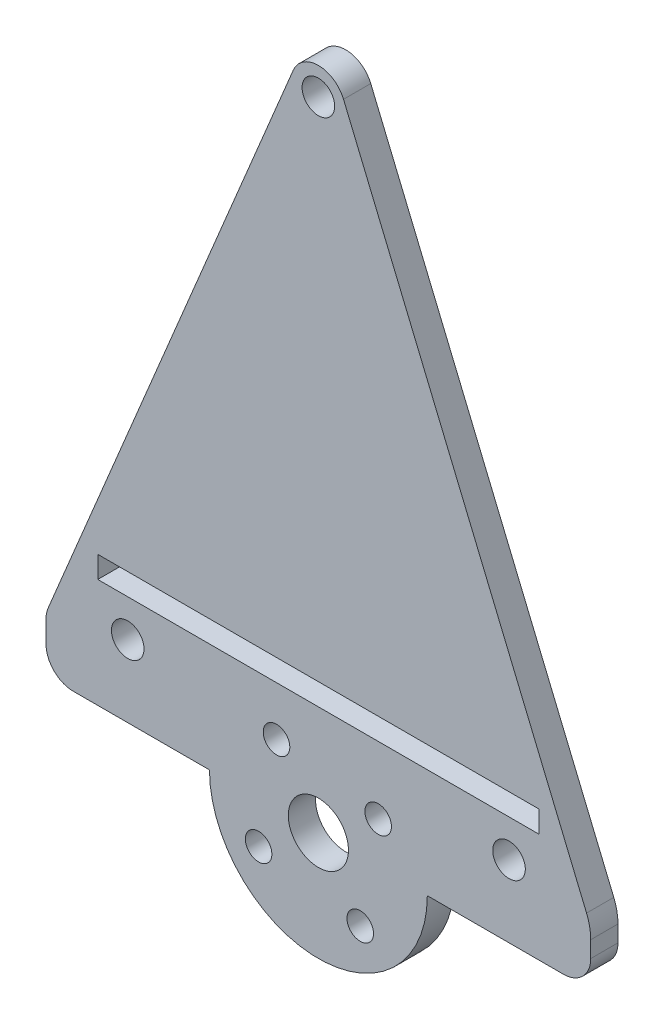
ISO-10303-21;
HEADER;
FILE_DESCRIPTION(('STEP AP214'),'2;1');
FILE_NAME('part.step','',(''),(''),'','','');
FILE_SCHEMA(('AUTOMOTIVE_DESIGN { 1 0 10303 214 1 1 1 1 }'));
ENDSEC;
DATA;
#1=APPLICATION_CONTEXT('core data for automotive mechanical design processes');
#2=APPLICATION_PROTOCOL_DEFINITION('international standard','automotive_design',2000,#1);
#3=PRODUCT_CONTEXT('',#1,'mechanical');
#4=PRODUCT('Part','Part','',(#3));
#5=PRODUCT_RELATED_PRODUCT_CATEGORY('part','',(#4));
#6=PRODUCT_DEFINITION_FORMATION('','',#4);
#7=PRODUCT_DEFINITION_CONTEXT('part definition',#1,'design');
#8=PRODUCT_DEFINITION('design','',#6,#7);
#9=PRODUCT_DEFINITION_SHAPE('','',#8);
#10=(LENGTH_UNIT() NAMED_UNIT(*) SI_UNIT(.MILLI.,.METRE.));
#11=(NAMED_UNIT(*) PLANE_ANGLE_UNIT() SI_UNIT($,.RADIAN.));
#12=(NAMED_UNIT(*) SI_UNIT($,.STERADIAN.) SOLID_ANGLE_UNIT());
#13=UNCERTAINTY_MEASURE_WITH_UNIT(LENGTH_MEASURE(1.E-05),#10,'distance_accuracy_value','');
#14=(GEOMETRIC_REPRESENTATION_CONTEXT(3) GLOBAL_UNCERTAINTY_ASSIGNED_CONTEXT((#13)) GLOBAL_UNIT_ASSIGNED_CONTEXT((#10,
#11,#12)) REPRESENTATION_CONTEXT('',''));
#15=CARTESIAN_POINT('',(0.,0.,0.));
#16=DIRECTION('',(0.,0.,1.));
#17=DIRECTION('',(1.,0.,0.));
#18=AXIS2_PLACEMENT_3D('',#15,#16,#17);
#19=CARTESIAN_POINT('',(28.575,-3.175,3.175));
#20=DIRECTION('',(0.,0.,-1.));
#21=DIRECTION('',(-1.,0.,0.));
#22=AXIS2_PLACEMENT_3D('',#19,#20,#21);
#23=CYLINDRICAL_SURFACE('',#22,3.175);
#24=DIRECTION('',(0.,0.,-1.));
#25=VECTOR('',#24,1.);
#26=CARTESIAN_POINT('',(31.75,-3.175,3.175));
#27=LINE('',#26,#25);
#28=CARTESIAN_POINT('',(31.75,-3.175,3.175));
#29=VERTEX_POINT('',#28);
#30=CARTESIAN_POINT('',(31.75,-3.175,0.));
#31=VERTEX_POINT('',#30);
#32=EDGE_CURVE('E294',#29,#31,#27,.T.);
#33=ORIENTED_EDGE('',*,*,#32,.F.);
#34=CARTESIAN_POINT('',(28.575,-3.175,3.175));
#35=DIRECTION('',(0.,0.,1.));
#36=DIRECTION('',(1.,0.,0.));
#37=AXIS2_PLACEMENT_3D('',#34,#35,#36);
#38=CIRCLE('',#37,3.175);
#39=CARTESIAN_POINT('',(28.575,-6.35,3.175));
#40=VERTEX_POINT('',#39);
#41=EDGE_CURVE('E40',#40,#29,#38,.T.);
#42=ORIENTED_EDGE('',*,*,#41,.F.);
#43=DIRECTION('',(0.,0.,-1.));
#44=VECTOR('',#43,1.);
#45=CARTESIAN_POINT('',(28.575,-6.35,3.175));
#46=LINE('',#45,#44);
#47=CARTESIAN_POINT('',(28.575,-6.35,0.));
#48=VERTEX_POINT('',#47);
#49=EDGE_CURVE('E297',#48,#40,#46,.F.);
#50=ORIENTED_EDGE('',*,*,#49,.F.);
#51=CARTESIAN_POINT('',(28.575,-3.175,0.));
#52=DIRECTION('',(0.,0.,1.));
#53=DIRECTION('',(1.,0.,0.));
#54=AXIS2_PLACEMENT_3D('',#51,#52,#53);
#55=CIRCLE('',#54,3.175);
#56=EDGE_CURVE('E11',#31,#48,#55,.F.);
#57=ORIENTED_EDGE('',*,*,#56,.F.);
#58=EDGE_LOOP('',(#33,#42,#50,#57));
#59=FACE_BOUND('',#58,.T.);
#60=ADVANCED_FACE('F33',(#59),#23,.T.);
#61=CARTESIAN_POINT('',(25.4,-1.26999999999999,3.175));
#62=DIRECTION('',(0.,0.,-1.));
#63=DIRECTION('',(-1.,0.,0.));
#64=AXIS2_PLACEMENT_3D('',#61,#62,#63);
#65=CYLINDRICAL_SURFACE('',#64,6.35);
#66=DIRECTION('',(0.,0.,-1.));
#67=VECTOR('',#66,1.);
#68=CARTESIAN_POINT('',(31.2615384615385,1.17230769230768,3.175));
#69=LINE('',#68,#67);
#70=CARTESIAN_POINT('',(31.2615384615385,1.17230769230768,3.175));
#71=VERTEX_POINT('',#70);
#72=CARTESIAN_POINT('',(31.2615384615385,1.17230769230768,0.));
#73=VERTEX_POINT('',#72);
#74=EDGE_CURVE('E283',#71,#73,#69,.T.);
#75=ORIENTED_EDGE('',*,*,#74,.F.);
#76=CARTESIAN_POINT('',(25.4,-1.26999999999999,3.175));
#77=DIRECTION('',(0.,0.,1.));
#78=DIRECTION('',(1.,0.,0.));
#79=AXIS2_PLACEMENT_3D('',#76,#77,#78);
#80=CIRCLE('',#79,6.35);
#81=CARTESIAN_POINT('',(31.75,-1.26999999999999,3.175));
#82=VERTEX_POINT('',#81);
#83=EDGE_CURVE('E289',#82,#71,#80,.T.);
#84=ORIENTED_EDGE('',*,*,#83,.F.);
#85=DIRECTION('',(0.,0.,-1.));
#86=VECTOR('',#85,1.);
#87=CARTESIAN_POINT('',(31.75,-1.26999999999999,3.175));
#88=LINE('',#87,#86);
#89=CARTESIAN_POINT('',(31.75,-1.26999999999999,0.));
#90=VERTEX_POINT('',#89);
#91=EDGE_CURVE('E286',#90,#82,#88,.F.);
#92=ORIENTED_EDGE('',*,*,#91,.F.);
#93=CARTESIAN_POINT('',(25.4,-1.26999999999999,0.));
#94=DIRECTION('',(0.,0.,1.));
#95=DIRECTION('',(1.,0.,0.));
#96=AXIS2_PLACEMENT_3D('',#93,#94,#95);
#97=CIRCLE('',#96,6.35);
#98=EDGE_CURVE('E291',#73,#90,#97,.F.);
#99=ORIENTED_EDGE('',*,*,#98,.F.);
#100=EDGE_LOOP('',(#75,#84,#92,#99));
#101=FACE_BOUND('',#100,.T.);
#102=ADVANCED_FACE('F313',(#101),#65,.T.);
#103=CARTESIAN_POINT('',(0.,67.945,3.175));
#104=DIRECTION('',(0.,0.,-1.));
#105=DIRECTION('',(-1.,0.,0.));
#106=AXIS2_PLACEMENT_3D('',#103,#104,#105);
#107=CYLINDRICAL_SURFACE('',#106,3.175);
#108=DIRECTION('',(0.,0.,-1.));
#109=VECTOR('',#108,1.);
#110=CARTESIAN_POINT('',(-2.93076923076923,69.1661538461538,3.175));
#111=LINE('',#110,#109);
#112=CARTESIAN_POINT('',(-2.93076923076923,69.1661538461538,3.175));
#113=VERTEX_POINT('',#112);
#114=CARTESIAN_POINT('',(-2.93076923076923,69.1661538461538,0.));
#115=VERTEX_POINT('',#114);
#116=EDGE_CURVE('E272',#113,#115,#111,.T.);
#117=ORIENTED_EDGE('',*,*,#116,.F.);
#118=CARTESIAN_POINT('',(0.,67.945,3.175));
#119=DIRECTION('',(0.,0.,1.));
#120=DIRECTION('',(1.,0.,0.));
#121=AXIS2_PLACEMENT_3D('',#118,#119,#120);
#122=CIRCLE('',#121,3.175);
#123=CARTESIAN_POINT('',(2.93076923076923,69.1661538461538,3.175));
#124=VERTEX_POINT('',#123);
#125=EDGE_CURVE('E278',#124,#113,#122,.T.);
#126=ORIENTED_EDGE('',*,*,#125,.F.);
#127=DIRECTION('',(0.,0.,-1.));
#128=VECTOR('',#127,1.);
#129=CARTESIAN_POINT('',(2.93076923076923,69.1661538461538,3.175));
#130=LINE('',#129,#128);
#131=CARTESIAN_POINT('',(2.93076923076923,69.1661538461538,0.));
#132=VERTEX_POINT('',#131);
#133=EDGE_CURVE('E275',#132,#124,#130,.F.);
#134=ORIENTED_EDGE('',*,*,#133,.F.);
#135=CARTESIAN_POINT('',(0.,67.945,0.));
#136=DIRECTION('',(0.,0.,1.));
#137=DIRECTION('',(1.,0.,0.));
#138=AXIS2_PLACEMENT_3D('',#135,#136,#137);
#139=CIRCLE('',#138,3.175);
#140=EDGE_CURVE('E280',#115,#132,#139,.F.);
#141=ORIENTED_EDGE('',*,*,#140,.F.);
#142=EDGE_LOOP('',(#117,#126,#134,#141));
#143=FACE_BOUND('',#142,.T.);
#144=ADVANCED_FACE('F320',(#143),#107,.T.);
#145=CARTESIAN_POINT('',(-28.575,-0.634999999999997,3.175));
#146=DIRECTION('',(0.,0.,1.));
#147=DIRECTION('',(1.,0.,0.));
#148=AXIS2_PLACEMENT_3D('',#145,#146,#147);
#149=CYLINDRICAL_SURFACE('',#148,3.175);
#150=DIRECTION('',(0.,0.,1.));
#151=VECTOR('',#150,1.);
#152=CARTESIAN_POINT('',(-31.5057692307692,0.586153846153847,3.175));
#153=LINE('',#152,#151);
#154=CARTESIAN_POINT('',(-31.5057692307692,0.586153846153861,0.));
#155=VERTEX_POINT('',#154);
#156=CARTESIAN_POINT('',(-31.5057692307692,0.586153846153861,3.175));
#157=VERTEX_POINT('',#156);
#158=EDGE_CURVE('E261',#155,#157,#153,.T.);
#159=ORIENTED_EDGE('',*,*,#158,.F.);
#160=CARTESIAN_POINT('',(-28.575,-0.634999999999997,0.));
#161=DIRECTION('',(0.,0.,1.));
#162=DIRECTION('',(1.,0.,0.));
#163=AXIS2_PLACEMENT_3D('',#160,#161,#162);
#164=CIRCLE('',#163,3.175);
#165=CARTESIAN_POINT('',(-31.75,-0.634999999999987,0.));
#166=VERTEX_POINT('',#165);
#167=EDGE_CURVE('E267',#166,#155,#164,.F.);
#168=ORIENTED_EDGE('',*,*,#167,.F.);
#169=DIRECTION('',(0.,0.,1.));
#170=VECTOR('',#169,1.);
#171=CARTESIAN_POINT('',(-31.75,-0.634999999999997,3.175));
#172=LINE('',#171,#170);
#173=CARTESIAN_POINT('',(-31.75,-0.634999999999987,3.175));
#174=VERTEX_POINT('',#173);
#175=EDGE_CURVE('E264',#174,#166,#172,.F.);
#176=ORIENTED_EDGE('',*,*,#175,.F.);
#177=CARTESIAN_POINT('',(-28.575,-0.634999999999997,3.175));
#178=DIRECTION('',(0.,0.,1.));
#179=DIRECTION('',(1.,0.,0.));
#180=AXIS2_PLACEMENT_3D('',#177,#178,#179);
#181=CIRCLE('',#180,3.175);
#182=EDGE_CURVE('E270',#157,#174,#181,.T.);
#183=ORIENTED_EDGE('',*,*,#182,.F.);
#184=EDGE_LOOP('',(#159,#168,#176,#183));
#185=FACE_BOUND('',#184,.T.);
#186=ADVANCED_FACE('F332',(#185),#149,.T.);
#187=CARTESIAN_POINT('',(-28.575,-3.175,3.175));
#188=DIRECTION('',(0.,0.,-1.));
#189=DIRECTION('',(-1.,0.,0.));
#190=AXIS2_PLACEMENT_3D('',#187,#188,#189);
#191=CYLINDRICAL_SURFACE('',#190,3.175);
#192=DIRECTION('',(0.,0.,-1.));
#193=VECTOR('',#192,1.);
#194=CARTESIAN_POINT('',(-28.575,-6.35,3.175));
#195=LINE('',#194,#193);
#196=CARTESIAN_POINT('',(-28.575,-6.35,3.175));
#197=VERTEX_POINT('',#196);
#198=CARTESIAN_POINT('',(-28.575,-6.35,0.));
#199=VERTEX_POINT('',#198);
#200=EDGE_CURVE('E250',#197,#199,#195,.T.);
#201=ORIENTED_EDGE('',*,*,#200,.F.);
#202=CARTESIAN_POINT('',(-28.575,-3.175,3.175));
#203=DIRECTION('',(0.,0.,1.));
#204=DIRECTION('',(1.,0.,0.));
#205=AXIS2_PLACEMENT_3D('',#202,#203,#204);
#206=CIRCLE('',#205,3.175);
#207=CARTESIAN_POINT('',(-31.75,-3.175,3.175));
#208=VERTEX_POINT('',#207);
#209=EDGE_CURVE('E256',#208,#197,#206,.T.);
#210=ORIENTED_EDGE('',*,*,#209,.F.);
#211=DIRECTION('',(0.,0.,-1.));
#212=VECTOR('',#211,1.);
#213=CARTESIAN_POINT('',(-31.75,-3.175,3.175));
#214=LINE('',#213,#212);
#215=CARTESIAN_POINT('',(-31.75,-3.175,0.));
#216=VERTEX_POINT('',#215);
#217=EDGE_CURVE('E253',#216,#208,#214,.F.);
#218=ORIENTED_EDGE('',*,*,#217,.F.);
#219=CARTESIAN_POINT('',(-28.575,-3.175,0.));
#220=DIRECTION('',(0.,0.,1.));
#221=DIRECTION('',(1.,0.,0.));
#222=AXIS2_PLACEMENT_3D('',#219,#220,#221);
#223=CIRCLE('',#222,3.175);
#224=EDGE_CURVE('E258',#199,#216,#223,.F.);
#225=ORIENTED_EDGE('',*,*,#224,.F.);
#226=EDGE_LOOP('',(#201,#210,#218,#225));
#227=FACE_BOUND('',#226,.T.);
#228=ADVANCED_FACE('F341',(#227),#191,.T.);
#229=CARTESIAN_POINT('',(0.,76.2,3.175));
#230=DIRECTION('',(-0.923076923076923,-0.384615384615385,0.));
#231=DIRECTION('',(0.384615384615385,-0.923076923076923,0.));
#232=AXIS2_PLACEMENT_3D('',#229,#230,#231);
#233=PLANE('',#232);
#234=DIRECTION('',(-0.384615384615385,0.923076923076923,0.));
#235=VECTOR('',#234,1.);
#236=CARTESIAN_POINT('',(0.,76.2,3.175));
#237=LINE('',#236,#235);
#238=EDGE_CURVE('E215',#71,#124,#237,.T.);
#239=ORIENTED_EDGE('',*,*,#238,.F.);
#240=ORIENTED_EDGE('',*,*,#74,.T.);
#241=DIRECTION('',(-0.384615384615385,0.923076923076923,0.));
#242=VECTOR('',#241,1.);
#243=CARTESIAN_POINT('',(0.,76.2,0.));
#244=LINE('',#243,#242);
#245=EDGE_CURVE('E212',#73,#132,#244,.T.);
#246=ORIENTED_EDGE('',*,*,#245,.T.);
#247=ORIENTED_EDGE('',*,*,#133,.T.);
#248=EDGE_LOOP('',(#239,#240,#246,#247));
#249=FACE_BOUND('',#248,.T.);
#250=ADVANCED_FACE('F322',(#249),#233,.F.);
#251=CARTESIAN_POINT('',(0.,76.2,3.175));
#252=DIRECTION('',(0.923076923076923,-0.384615384615385,0.));
#253=DIRECTION('',(0.384615384615385,0.923076923076923,0.));
#254=AXIS2_PLACEMENT_3D('',#251,#252,#253);
#255=PLANE('',#254);
#256=DIRECTION('',(-0.384615384615385,-0.923076923076923,0.));
#257=VECTOR('',#256,1.);
#258=CARTESIAN_POINT('',(0.,76.2,3.175));
#259=LINE('',#258,#257);
#260=EDGE_CURVE('E217',#113,#157,#259,.T.);
#261=ORIENTED_EDGE('',*,*,#260,.F.);
#262=ORIENTED_EDGE('',*,*,#116,.T.);
#263=DIRECTION('',(-0.384615384615385,-0.923076923076923,0.));
#264=VECTOR('',#263,1.);
#265=CARTESIAN_POINT('',(0.,76.2,0.));
#266=LINE('',#265,#264);
#267=EDGE_CURVE('E233',#115,#155,#266,.T.);
#268=ORIENTED_EDGE('',*,*,#267,.T.);
#269=ORIENTED_EDGE('',*,*,#158,.T.);
#270=EDGE_LOOP('',(#261,#262,#268,#269));
#271=FACE_BOUND('',#270,.T.);
#272=ADVANCED_FACE('F327',(#271),#255,.F.);
#273=CARTESIAN_POINT('',(-31.75,0.,3.175));
#274=DIRECTION('',(1.,0.,0.));
#275=DIRECTION('',(0.,0.,-1.));
#276=AXIS2_PLACEMENT_3D('',#273,#274,#275);
#277=PLANE('',#276);
#278=DIRECTION('',(0.,-1.,0.));
#279=VECTOR('',#278,1.);
#280=CARTESIAN_POINT('',(-31.75,0.,3.175));
#281=LINE('',#280,#279);
#282=EDGE_CURVE('E220',#174,#208,#281,.T.);
#283=ORIENTED_EDGE('',*,*,#282,.F.);
#284=ORIENTED_EDGE('',*,*,#175,.T.);
#285=DIRECTION('',(0.,-1.,0.));
#286=VECTOR('',#285,1.);
#287=CARTESIAN_POINT('',(-31.75,0.,0.));
#288=LINE('',#287,#286);
#289=EDGE_CURVE('E235',#166,#216,#288,.T.);
#290=ORIENTED_EDGE('',*,*,#289,.T.);
#291=ORIENTED_EDGE('',*,*,#217,.T.);
#292=EDGE_LOOP('',(#283,#284,#290,#291));
#293=FACE_BOUND('',#292,.T.);
#294=ADVANCED_FACE('F336',(#293),#277,.F.);
#295=CARTESIAN_POINT('',(-31.75,-6.35,3.175));
#296=DIRECTION('',(0.,1.,0.));
#297=DIRECTION('',(0.,0.,1.));
#298=AXIS2_PLACEMENT_3D('',#295,#296,#297);
#299=PLANE('',#298);
#300=DIRECTION('',(1.,0.,0.));
#301=VECTOR('',#300,1.);
#302=CARTESIAN_POINT('',(-31.75,-6.35,3.175));
#303=LINE('',#302,#301);
#304=CARTESIAN_POINT('',(-12.7,-6.35,3.175));
#305=VERTEX_POINT('',#304);
#306=EDGE_CURVE('E222',#197,#305,#303,.T.);
#307=ORIENTED_EDGE('',*,*,#306,.F.);
#308=ORIENTED_EDGE('',*,*,#200,.T.);
#309=DIRECTION('',(1.,0.,0.));
#310=VECTOR('',#309,1.);
#311=CARTESIAN_POINT('',(-31.75,-6.35,0.));
#312=LINE('',#311,#310);
#313=CARTESIAN_POINT('',(-12.7,-6.35,0.));
#314=VERTEX_POINT('',#313);
#315=EDGE_CURVE('E237',#199,#314,#312,.T.);
#316=ORIENTED_EDGE('',*,*,#315,.T.);
#317=DIRECTION('',(0.,0.,-1.));
#318=VECTOR('',#317,1.);
#319=CARTESIAN_POINT('',(-12.7,-6.35,3.175));
#320=LINE('',#319,#318);
#321=EDGE_CURVE('E247',#305,#314,#320,.T.);
#322=ORIENTED_EDGE('',*,*,#321,.F.);
#323=EDGE_LOOP('',(#307,#308,#316,#322));
#324=FACE_BOUND('',#323,.T.);
#325=ADVANCED_FACE('F346',(#324),#299,.F.);
#326=CARTESIAN_POINT('',(0.,-6.35,3.175));
#327=DIRECTION('',(0.,0.,-1.));
#328=DIRECTION('',(-1.,0.,0.));
#329=AXIS2_PLACEMENT_3D('',#326,#327,#328);
#330=CYLINDRICAL_SURFACE('',#329,12.7);
#331=CARTESIAN_POINT('',(0.,-6.35,0.));
#332=DIRECTION('',(0.,0.,1.));
#333=DIRECTION('',(1.,0.,0.));
#334=AXIS2_PLACEMENT_3D('',#331,#332,#333);
#335=CIRCLE('',#334,12.7);
#336=CARTESIAN_POINT('',(12.7,-6.35,0.));
#337=VERTEX_POINT('',#336);
#338=EDGE_CURVE('E239',#314,#337,#335,.T.);
#339=ORIENTED_EDGE('',*,*,#338,.T.);
#340=DIRECTION('',(0.,0.,-1.));
#341=VECTOR('',#340,1.);
#342=CARTESIAN_POINT('',(12.7,-6.35,3.175));
#343=LINE('',#342,#341);
#344=CARTESIAN_POINT('',(12.7,-6.35,3.175));
#345=VERTEX_POINT('',#344);
#346=EDGE_CURVE('E231',#345,#337,#343,.T.);
#347=ORIENTED_EDGE('',*,*,#346,.F.);
#348=CARTESIAN_POINT('',(0.,-6.35,3.175));
#349=DIRECTION('',(0.,0.,1.));
#350=DIRECTION('',(1.,0.,0.));
#351=AXIS2_PLACEMENT_3D('',#348,#349,#350);
#352=CIRCLE('',#351,12.7);
#353=EDGE_CURVE('E224',#305,#345,#352,.T.);
#354=ORIENTED_EDGE('',*,*,#353,.F.);
#355=ORIENTED_EDGE('',*,*,#321,.T.);
#356=EDGE_LOOP('',(#339,#347,#354,#355));
#357=FACE_BOUND('',#356,.T.);
#358=ADVANCED_FACE('F350',(#357),#330,.T.);
#359=CARTESIAN_POINT('',(31.75,-6.35,3.175));
#360=DIRECTION('',(0.,1.,0.));
#361=DIRECTION('',(-1.,0.,0.));
#362=AXIS2_PLACEMENT_3D('',#359,#360,#361);
#363=PLANE('',#362);
#364=DIRECTION('',(1.,0.,0.));
#365=VECTOR('',#364,1.);
#366=CARTESIAN_POINT('',(31.75,-6.35,0.));
#367=LINE('',#366,#365);
#368=EDGE_CURVE('E241',#337,#48,#367,.T.);
#369=ORIENTED_EDGE('',*,*,#368,.T.);
#370=ORIENTED_EDGE('',*,*,#49,.T.);
#371=DIRECTION('',(1.,0.,0.));
#372=VECTOR('',#371,1.);
#373=CARTESIAN_POINT('',(31.75,-6.35,3.175));
#374=LINE('',#373,#372);
#375=EDGE_CURVE('E226',#345,#40,#374,.T.);
#376=ORIENTED_EDGE('',*,*,#375,.F.);
#377=ORIENTED_EDGE('',*,*,#346,.T.);
#378=EDGE_LOOP('',(#369,#370,#376,#377));
#379=FACE_BOUND('',#378,.T.);
#380=ADVANCED_FACE('F354',(#379),#363,.F.);
#381=CARTESIAN_POINT('',(31.75,0.,3.175));
#382=DIRECTION('',(-1.,0.,0.));
#383=DIRECTION('',(0.,0.,1.));
#384=AXIS2_PLACEMENT_3D('',#381,#382,#383);
#385=PLANE('',#384);
#386=DIRECTION('',(0.,1.,0.));
#387=VECTOR('',#386,1.);
#388=CARTESIAN_POINT('',(31.75,0.,3.175));
#389=LINE('',#388,#387);
#390=EDGE_CURVE('E229',#29,#82,#389,.T.);
#391=ORIENTED_EDGE('',*,*,#390,.F.);
#392=ORIENTED_EDGE('',*,*,#32,.T.);
#393=DIRECTION('',(0.,1.,0.));
#394=VECTOR('',#393,1.);
#395=CARTESIAN_POINT('',(31.75,0.,0.));
#396=LINE('',#395,#394);
#397=EDGE_CURVE('E218',#31,#90,#396,.T.);
#398=ORIENTED_EDGE('',*,*,#397,.T.);
#399=ORIENTED_EDGE('',*,*,#91,.T.);
#400=EDGE_LOOP('',(#391,#392,#398,#399));
#401=FACE_BOUND('',#400,.T.);
#402=ADVANCED_FACE('F309',(#401),#385,.F.);
#403=CARTESIAN_POINT('',(0.,-6.35,3.175));
#404=DIRECTION('',(0.,0.,1.));
#405=DIRECTION('',(1.,0.,0.));
#406=AXIS2_PLACEMENT_3D('',#403,#404,#405);
#407=PLANE('',#406);
#408=CARTESIAN_POINT('',(0.,67.945,3.175));
#409=DIRECTION('',(0.,0.,1.));
#410=DIRECTION('',(1.,0.,0.));
#411=AXIS2_PLACEMENT_3D('',#408,#409,#410);
#412=CIRCLE('',#411,1.89865);
#413=CARTESIAN_POINT('',(1.89865,67.945,3.175));
#414=VERTEX_POINT('',#413);
#415=EDGE_CURVE('E563',#414,#414,#412,.T.);
#416=ORIENTED_EDGE('',*,*,#415,.F.);
#417=EDGE_LOOP('',(#416));
#418=FACE_BOUND('',#417,.T.);
#419=CARTESIAN_POINT('',(22.225,2.034299946,3.175));
#420=DIRECTION('',(0.,0.,1.));
#421=DIRECTION('',(-1.,0.,0.));
#422=AXIS2_PLACEMENT_3D('',#419,#420,#421);
#423=CIRCLE('',#422,1.89865);
#424=CARTESIAN_POINT('',(20.32635,2.034299946,3.175));
#425=VERTEX_POINT('',#424);
#426=EDGE_CURVE('E567',#425,#425,#423,.T.);
#427=ORIENTED_EDGE('',*,*,#426,.F.);
#428=EDGE_LOOP('',(#427));
#429=FACE_BOUND('',#428,.T.);
#430=CARTESIAN_POINT('',(-22.225,2.034299946,3.175));
#431=DIRECTION('',(0.,0.,1.));
#432=DIRECTION('',(1.,0.,0.));
#433=AXIS2_PLACEMENT_3D('',#430,#431,#432);
#434=CIRCLE('',#433,1.89865);
#435=CARTESIAN_POINT('',(-20.32635,2.034299946,3.175));
#436=VERTEX_POINT('',#435);
#437=EDGE_CURVE('E168',#436,#436,#434,.T.);
#438=ORIENTED_EDGE('',*,*,#437,.F.);
#439=EDGE_LOOP('',(#438));
#440=FACE_BOUND('',#439,.T.);
#441=DIRECTION('',(0.,-1.,0.));
#442=VECTOR('',#441,1.);
#443=CARTESIAN_POINT('',(-25.7175,6.364999946,3.175));
#444=LINE('',#443,#442);
#445=CARTESIAN_POINT('',(-25.7175,8.904999946,3.175));
#446=VERTEX_POINT('',#445);
#447=CARTESIAN_POINT('',(-25.7175,6.364999946,3.175));
#448=VERTEX_POINT('',#447);
#449=EDGE_CURVE('E47',#446,#448,#444,.T.);
#450=ORIENTED_EDGE('',*,*,#449,.F.);
#451=DIRECTION('',(-1.,0.,0.));
#452=VECTOR('',#451,1.);
#453=CARTESIAN_POINT('',(25.7175,8.904999946,3.175));
#454=LINE('',#453,#452);
#455=CARTESIAN_POINT('',(25.7175,8.904999946,3.175));
#456=VERTEX_POINT('',#455);
#457=EDGE_CURVE('E162',#456,#446,#454,.T.);
#458=ORIENTED_EDGE('',*,*,#457,.F.);
#459=DIRECTION('',(0.,1.,0.));
#460=VECTOR('',#459,1.);
#461=CARTESIAN_POINT('',(25.7175,6.364999946,3.175));
#462=LINE('',#461,#460);
#463=CARTESIAN_POINT('',(25.7175,6.364999946,3.175));
#464=VERTEX_POINT('',#463);
#465=EDGE_CURVE('E165',#464,#456,#462,.T.);
#466=ORIENTED_EDGE('',*,*,#465,.F.);
#467=DIRECTION('',(1.,0.,0.));
#468=VECTOR('',#467,1.);
#469=CARTESIAN_POINT('',(25.7175,6.364999946,3.175));
#470=LINE('',#469,#468);
#471=EDGE_CURVE('E174',#448,#464,#470,.T.);
#472=ORIENTED_EDGE('',*,*,#471,.F.);
#473=EDGE_LOOP('',(#450,#458,#466,#472));
#474=FACE_BOUND('',#473,.T.);
#475=CARTESIAN_POINT('',(-6.97016474485501,-11.2305618969111,3.175));
#476=DIRECTION('',(0.,0.,1.));
#477=DIRECTION('',(-1.,0.,0.));
#478=AXIS2_PLACEMENT_3D('',#475,#476,#477);
#479=CIRCLE('',#478,1.5494);
#480=CARTESIAN_POINT('',(-8.51956474485501,-11.2305618969111,3.175));
#481=VERTEX_POINT('',#480);
#482=EDGE_CURVE('E181',#481,#481,#479,.T.);
#483=ORIENTED_EDGE('',*,*,#482,.F.);
#484=EDGE_LOOP('',(#483));
#485=FACE_BOUND('',#484,.T.);
#486=CARTESIAN_POINT('',(6.97016474485501,-1.46943810308892,3.175));
#487=DIRECTION('',(0.,0.,1.));
#488=DIRECTION('',(1.,0.,0.));
#489=AXIS2_PLACEMENT_3D('',#486,#487,#488);
#490=CIRCLE('',#489,1.5494);
#491=CARTESIAN_POINT('',(8.51956474485501,-1.46943810308892,3.175));
#492=VERTEX_POINT('',#491);
#493=EDGE_CURVE('E188',#492,#492,#490,.T.);
#494=ORIENTED_EDGE('',*,*,#493,.F.);
#495=EDGE_LOOP('',(#494));
#496=FACE_BOUND('',#495,.T.);
#497=CARTESIAN_POINT('',(4.88056189691109,-13.320164744855,3.175));
#498=DIRECTION('',(0.,0.,1.));
#499=DIRECTION('',(-1.,0.,0.));
#500=AXIS2_PLACEMENT_3D('',#497,#498,#499);
#501=CIRCLE('',#500,1.5494);
#502=CARTESIAN_POINT('',(3.33116189691109,-13.320164744855,3.175));
#503=VERTEX_POINT('',#502);
#504=EDGE_CURVE('E194',#503,#503,#501,.T.);
#505=ORIENTED_EDGE('',*,*,#504,.F.);
#506=EDGE_LOOP('',(#505));
#507=FACE_BOUND('',#506,.T.);
#508=CARTESIAN_POINT('',(-4.88056189691109,0.620164744855005,3.175));
#509=DIRECTION('',(0.,0.,1.));
#510=DIRECTION('',(1.,0.,0.));
#511=AXIS2_PLACEMENT_3D('',#508,#509,#510);
#512=CIRCLE('',#511,1.5494);
#513=CARTESIAN_POINT('',(-3.33116189691109,0.620164744855005,3.175));
#514=VERTEX_POINT('',#513);
#515=EDGE_CURVE('E200',#514,#514,#512,.T.);
#516=ORIENTED_EDGE('',*,*,#515,.F.);
#517=EDGE_LOOP('',(#516));
#518=FACE_BOUND('',#517,.T.);
#519=CARTESIAN_POINT('',(0.,-6.35,3.175));
#520=DIRECTION('',(0.,0.,1.));
#521=DIRECTION('',(1.,0.,0.));
#522=AXIS2_PLACEMENT_3D('',#519,#520,#521);
#523=CIRCLE('',#522,3.5052);
#524=CARTESIAN_POINT('',(3.5052,-6.35,3.175));
#525=VERTEX_POINT('',#524);
#526=EDGE_CURVE('E206',#525,#525,#523,.T.);
#527=ORIENTED_EDGE('',*,*,#526,.F.);
#528=EDGE_LOOP('',(#527));
#529=FACE_BOUND('',#528,.T.);
#530=ORIENTED_EDGE('',*,*,#375,.T.);
#531=ORIENTED_EDGE('',*,*,#41,.T.);
#532=ORIENTED_EDGE('',*,*,#390,.T.);
#533=ORIENTED_EDGE('',*,*,#83,.T.);
#534=ORIENTED_EDGE('',*,*,#238,.T.);
#535=ORIENTED_EDGE('',*,*,#125,.T.);
#536=ORIENTED_EDGE('',*,*,#260,.T.);
#537=ORIENTED_EDGE('',*,*,#182,.T.);
#538=ORIENTED_EDGE('',*,*,#282,.T.);
#539=ORIENTED_EDGE('',*,*,#209,.T.);
#540=ORIENTED_EDGE('',*,*,#306,.T.);
#541=ORIENTED_EDGE('',*,*,#353,.T.);
#542=EDGE_LOOP('',(#530,#531,#532,#533,#534,#535,#536,#537,#538,#539,#540,#541));
#543=FACE_BOUND('',#542,.T.);
#544=ADVANCED_FACE('F301',(#418,#429,#440,#474,#485,#496,#507,#518,#529,#543),#407,.T.);
#545=CARTESIAN_POINT('',(0.,-6.35,0.));
#546=DIRECTION('',(0.,0.,1.));
#547=DIRECTION('',(1.,0.,0.));
#548=AXIS2_PLACEMENT_3D('',#545,#546,#547);
#549=PLANE('',#548);
#550=CARTESIAN_POINT('',(0.,67.945,0.));
#551=DIRECTION('',(0.,0.,1.));
#552=DIRECTION('',(1.,0.,0.));
#553=AXIS2_PLACEMENT_3D('',#550,#551,#552);
#554=CIRCLE('',#553,1.89865);
#555=CARTESIAN_POINT('',(1.89865,67.945,0.));
#556=VERTEX_POINT('',#555);
#557=EDGE_CURVE('E595',#556,#556,#554,.T.);
#558=ORIENTED_EDGE('',*,*,#557,.T.);
#559=EDGE_LOOP('',(#558));
#560=FACE_BOUND('',#559,.T.);
#561=CARTESIAN_POINT('',(22.225,2.034299946,0.));
#562=DIRECTION('',(0.,0.,1.));
#563=DIRECTION('',(-1.,0.,0.));
#564=AXIS2_PLACEMENT_3D('',#561,#562,#563);
#565=CIRCLE('',#564,1.89865);
#566=CARTESIAN_POINT('',(20.32635,2.034299946,0.));
#567=VERTEX_POINT('',#566);
#568=EDGE_CURVE('E589',#567,#567,#565,.T.);
#569=ORIENTED_EDGE('',*,*,#568,.T.);
#570=EDGE_LOOP('',(#569));
#571=FACE_BOUND('',#570,.T.);
#572=CARTESIAN_POINT('',(-22.225,2.034299946,0.));
#573=DIRECTION('',(0.,0.,1.));
#574=DIRECTION('',(1.,0.,0.));
#575=AXIS2_PLACEMENT_3D('',#572,#573,#574);
#576=CIRCLE('',#575,1.89865);
#577=CARTESIAN_POINT('',(-20.32635,2.034299946,0.));
#578=VERTEX_POINT('',#577);
#579=EDGE_CURVE('E175',#578,#578,#576,.T.);
#580=ORIENTED_EDGE('',*,*,#579,.T.);
#581=EDGE_LOOP('',(#580));
#582=FACE_BOUND('',#581,.T.);
#583=DIRECTION('',(-1.,0.,0.));
#584=VECTOR('',#583,1.);
#585=CARTESIAN_POINT('',(25.7175,8.904999946,0.));
#586=LINE('',#585,#584);
#587=CARTESIAN_POINT('',(25.7175,8.904999946,0.));
#588=VERTEX_POINT('',#587);
#589=CARTESIAN_POINT('',(-25.7175,8.904999946,0.));
#590=VERTEX_POINT('',#589);
#591=EDGE_CURVE('E152',#588,#590,#586,.T.);
#592=ORIENTED_EDGE('',*,*,#591,.T.);
#593=DIRECTION('',(0.,-1.,0.));
#594=VECTOR('',#593,1.);
#595=CARTESIAN_POINT('',(-25.7175,6.364999946,0.));
#596=LINE('',#595,#594);
#597=CARTESIAN_POINT('',(-25.7175,6.364999946,0.));
#598=VERTEX_POINT('',#597);
#599=EDGE_CURVE('E146',#590,#598,#596,.T.);
#600=ORIENTED_EDGE('',*,*,#599,.T.);
#601=DIRECTION('',(1.,0.,0.));
#602=VECTOR('',#601,1.);
#603=CARTESIAN_POINT('',(25.7175,6.364999946,0.));
#604=LINE('',#603,#602);
#605=CARTESIAN_POINT('',(25.7175,6.364999946,0.));
#606=VERTEX_POINT('',#605);
#607=EDGE_CURVE('E155',#598,#606,#604,.T.);
#608=ORIENTED_EDGE('',*,*,#607,.T.);
#609=DIRECTION('',(0.,1.,0.));
#610=VECTOR('',#609,1.);
#611=CARTESIAN_POINT('',(25.7175,6.364999946,0.));
#612=LINE('',#611,#610);
#613=EDGE_CURVE('E55',#606,#588,#612,.T.);
#614=ORIENTED_EDGE('',*,*,#613,.T.);
#615=EDGE_LOOP('',(#592,#600,#608,#614));
#616=FACE_BOUND('',#615,.T.);
#617=CARTESIAN_POINT('',(-6.97016474485501,-11.2305618969111,0.));
#618=DIRECTION('',(0.,0.,1.));
#619=DIRECTION('',(-1.,0.,0.));
#620=AXIS2_PLACEMENT_3D('',#617,#618,#619);
#621=CIRCLE('',#620,1.5494);
#622=CARTESIAN_POINT('',(-8.51956474485501,-11.2305618969111,0.));
#623=VERTEX_POINT('',#622);
#624=EDGE_CURVE('E185',#623,#623,#621,.T.);
#625=ORIENTED_EDGE('',*,*,#624,.T.);
#626=EDGE_LOOP('',(#625));
#627=FACE_BOUND('',#626,.T.);
#628=CARTESIAN_POINT('',(6.97016474485501,-1.46943810308892,0.));
#629=DIRECTION('',(0.,0.,1.));
#630=DIRECTION('',(1.,0.,0.));
#631=AXIS2_PLACEMENT_3D('',#628,#629,#630);
#632=CIRCLE('',#631,1.5494);
#633=CARTESIAN_POINT('',(8.51956474485501,-1.46943810308892,0.));
#634=VERTEX_POINT('',#633);
#635=EDGE_CURVE('E191',#634,#634,#632,.T.);
#636=ORIENTED_EDGE('',*,*,#635,.T.);
#637=EDGE_LOOP('',(#636));
#638=FACE_BOUND('',#637,.T.);
#639=CARTESIAN_POINT('',(4.88056189691109,-13.320164744855,0.));
#640=DIRECTION('',(0.,0.,1.));
#641=DIRECTION('',(-1.,0.,0.));
#642=AXIS2_PLACEMENT_3D('',#639,#640,#641);
#643=CIRCLE('',#642,1.5494);
#644=CARTESIAN_POINT('',(3.33116189691109,-13.320164744855,0.));
#645=VERTEX_POINT('',#644);
#646=EDGE_CURVE('E197',#645,#645,#643,.T.);
#647=ORIENTED_EDGE('',*,*,#646,.T.);
#648=EDGE_LOOP('',(#647));
#649=FACE_BOUND('',#648,.T.);
#650=CARTESIAN_POINT('',(-4.88056189691109,0.620164744855005,0.));
#651=DIRECTION('',(0.,0.,1.));
#652=DIRECTION('',(1.,0.,0.));
#653=AXIS2_PLACEMENT_3D('',#650,#651,#652);
#654=CIRCLE('',#653,1.5494);
#655=CARTESIAN_POINT('',(-3.33116189691109,0.620164744855005,0.));
#656=VERTEX_POINT('',#655);
#657=EDGE_CURVE('E203',#656,#656,#654,.T.);
#658=ORIENTED_EDGE('',*,*,#657,.T.);
#659=EDGE_LOOP('',(#658));
#660=FACE_BOUND('',#659,.T.);
#661=CARTESIAN_POINT('',(0.,-6.35,0.));
#662=DIRECTION('',(0.,0.,1.));
#663=DIRECTION('',(1.,0.,0.));
#664=AXIS2_PLACEMENT_3D('',#661,#662,#663);
#665=CIRCLE('',#664,3.5052);
#666=CARTESIAN_POINT('',(3.5052,-6.35,0.));
#667=VERTEX_POINT('',#666);
#668=EDGE_CURVE('E209',#667,#667,#665,.T.);
#669=ORIENTED_EDGE('',*,*,#668,.T.);
#670=EDGE_LOOP('',(#669));
#671=FACE_BOUND('',#670,.T.);
#672=ORIENTED_EDGE('',*,*,#397,.F.);
#673=ORIENTED_EDGE('',*,*,#56,.T.);
#674=ORIENTED_EDGE('',*,*,#368,.F.);
#675=ORIENTED_EDGE('',*,*,#338,.F.);
#676=ORIENTED_EDGE('',*,*,#315,.F.);
#677=ORIENTED_EDGE('',*,*,#224,.T.);
#678=ORIENTED_EDGE('',*,*,#289,.F.);
#679=ORIENTED_EDGE('',*,*,#167,.T.);
#680=ORIENTED_EDGE('',*,*,#267,.F.);
#681=ORIENTED_EDGE('',*,*,#140,.T.);
#682=ORIENTED_EDGE('',*,*,#245,.F.);
#683=ORIENTED_EDGE('',*,*,#98,.T.);
#684=EDGE_LOOP('',(#672,#673,#674,#675,#676,#677,#678,#679,#680,#681,#682,#683));
#685=FACE_BOUND('',#684,.T.);
#686=ADVANCED_FACE('F159',(#560,#571,#582,#616,#627,#638,#649,#660,#671,#685),#549,.F.);
#687=CARTESIAN_POINT('',(0.,-6.35,0.));
#688=DIRECTION('',(0.,0.,1.));
#689=DIRECTION('',(1.,0.,0.));
#690=AXIS2_PLACEMENT_3D('',#687,#688,#689);
#691=CYLINDRICAL_SURFACE('',#690,3.5052);
#692=ORIENTED_EDGE('',*,*,#668,.F.);
#693=EDGE_LOOP('',(#692));
#694=FACE_BOUND('',#693,.T.);
#695=ORIENTED_EDGE('',*,*,#526,.T.);
#696=EDGE_LOOP('',(#695));
#697=FACE_BOUND('',#696,.T.);
#698=ADVANCED_FACE('F431',(#694,#697),#691,.F.);
#699=CARTESIAN_POINT('',(-4.88056189691109,0.620164744855005,0.));
#700=DIRECTION('',(0.,0.,1.));
#701=DIRECTION('',(1.,0.,0.));
#702=AXIS2_PLACEMENT_3D('',#699,#700,#701);
#703=CYLINDRICAL_SURFACE('',#702,1.5494);
#704=ORIENTED_EDGE('',*,*,#657,.F.);
#705=EDGE_LOOP('',(#704));
#706=FACE_BOUND('',#705,.T.);
#707=ORIENTED_EDGE('',*,*,#515,.T.);
#708=EDGE_LOOP('',(#707));
#709=FACE_BOUND('',#708,.T.);
#710=ADVANCED_FACE('F437',(#706,#709),#703,.F.);
#711=CARTESIAN_POINT('',(4.88056189691109,-13.320164744855,0.));
#712=DIRECTION('',(0.,0.,1.));
#713=DIRECTION('',(1.,0.,0.));
#714=AXIS2_PLACEMENT_3D('',#711,#712,#713);
#715=CYLINDRICAL_SURFACE('',#714,1.5494);
#716=ORIENTED_EDGE('',*,*,#646,.F.);
#717=EDGE_LOOP('',(#716));
#718=FACE_BOUND('',#717,.T.);
#719=ORIENTED_EDGE('',*,*,#504,.T.);
#720=EDGE_LOOP('',(#719));
#721=FACE_BOUND('',#720,.T.);
#722=ADVANCED_FACE('F447',(#718,#721),#715,.F.);
#723=CARTESIAN_POINT('',(6.97016474485501,-1.46943810308892,0.));
#724=DIRECTION('',(0.,0.,1.));
#725=DIRECTION('',(1.,0.,0.));
#726=AXIS2_PLACEMENT_3D('',#723,#724,#725);
#727=CYLINDRICAL_SURFACE('',#726,1.5494);
#728=ORIENTED_EDGE('',*,*,#635,.F.);
#729=EDGE_LOOP('',(#728));
#730=FACE_BOUND('',#729,.T.);
#731=ORIENTED_EDGE('',*,*,#493,.T.);
#732=EDGE_LOOP('',(#731));
#733=FACE_BOUND('',#732,.T.);
#734=ADVANCED_FACE('F456',(#730,#733),#727,.F.);
#735=CARTESIAN_POINT('',(-6.97016474485501,-11.2305618969111,0.));
#736=DIRECTION('',(0.,0.,1.));
#737=DIRECTION('',(1.,0.,0.));
#738=AXIS2_PLACEMENT_3D('',#735,#736,#737);
#739=CYLINDRICAL_SURFACE('',#738,1.5494);
#740=ORIENTED_EDGE('',*,*,#624,.F.);
#741=EDGE_LOOP('',(#740));
#742=FACE_BOUND('',#741,.T.);
#743=ORIENTED_EDGE('',*,*,#482,.T.);
#744=EDGE_LOOP('',(#743));
#745=FACE_BOUND('',#744,.T.);
#746=ADVANCED_FACE('F465',(#742,#745),#739,.F.);
#747=CARTESIAN_POINT('',(-25.7175,6.364999946,0.));
#748=DIRECTION('',(-1.,0.,0.));
#749=DIRECTION('',(0.,0.,1.));
#750=AXIS2_PLACEMENT_3D('',#747,#748,#749);
#751=PLANE('',#750);
#752=ORIENTED_EDGE('',*,*,#449,.T.);
#753=DIRECTION('',(0.,0.,1.));
#754=VECTOR('',#753,1.);
#755=CARTESIAN_POINT('',(-25.7175,6.364999946,0.));
#756=LINE('',#755,#754);
#757=EDGE_CURVE('E142',#598,#448,#756,.T.);
#758=ORIENTED_EDGE('',*,*,#757,.F.);
#759=ORIENTED_EDGE('',*,*,#599,.F.);
#760=DIRECTION('',(0.,0.,1.));
#761=VECTOR('',#760,1.);
#762=CARTESIAN_POINT('',(-25.7175,8.904999946,0.));
#763=LINE('',#762,#761);
#764=EDGE_CURVE('E179',#590,#446,#763,.T.);
#765=ORIENTED_EDGE('',*,*,#764,.T.);
#766=EDGE_LOOP('',(#752,#758,#759,#765));
#767=FACE_BOUND('',#766,.T.);
#768=ADVANCED_FACE('F144',(#767),#751,.F.);
#769=CARTESIAN_POINT('',(25.7175,8.904999946,0.));
#770=DIRECTION('',(0.,1.,0.));
#771=DIRECTION('',(-1.,0.,0.));
#772=AXIS2_PLACEMENT_3D('',#769,#770,#771);
#773=PLANE('',#772);
#774=ORIENTED_EDGE('',*,*,#457,.T.);
#775=ORIENTED_EDGE('',*,*,#764,.F.);
#776=ORIENTED_EDGE('',*,*,#591,.F.);
#777=DIRECTION('',(0.,0.,1.));
#778=VECTOR('',#777,1.);
#779=CARTESIAN_POINT('',(25.7175,8.904999946,0.));
#780=LINE('',#779,#778);
#781=EDGE_CURVE('E182',#588,#456,#780,.T.);
#782=ORIENTED_EDGE('',*,*,#781,.T.);
#783=EDGE_LOOP('',(#774,#775,#776,#782));
#784=FACE_BOUND('',#783,.T.);
#785=ADVANCED_FACE('F482',(#784),#773,.F.);
#786=CARTESIAN_POINT('',(25.7175,6.364999946,0.));
#787=DIRECTION('',(1.,0.,0.));
#788=DIRECTION('',(0.,0.,-1.));
#789=AXIS2_PLACEMENT_3D('',#786,#787,#788);
#790=PLANE('',#789);
#791=ORIENTED_EDGE('',*,*,#465,.T.);
#792=ORIENTED_EDGE('',*,*,#781,.F.);
#793=ORIENTED_EDGE('',*,*,#613,.F.);
#794=DIRECTION('',(0.,0.,1.));
#795=VECTOR('',#794,1.);
#796=CARTESIAN_POINT('',(25.7175,6.364999946,0.));
#797=LINE('',#796,#795);
#798=EDGE_CURVE('E151',#606,#464,#797,.T.);
#799=ORIENTED_EDGE('',*,*,#798,.T.);
#800=EDGE_LOOP('',(#791,#792,#793,#799));
#801=FACE_BOUND('',#800,.T.);
#802=ADVANCED_FACE('F490',(#801),#790,.F.);
#803=CARTESIAN_POINT('',(25.7175,6.364999946,0.));
#804=DIRECTION('',(0.,-1.,0.));
#805=DIRECTION('',(1.,0.,0.));
#806=AXIS2_PLACEMENT_3D('',#803,#804,#805);
#807=PLANE('',#806);
#808=ORIENTED_EDGE('',*,*,#471,.T.);
#809=ORIENTED_EDGE('',*,*,#798,.F.);
#810=ORIENTED_EDGE('',*,*,#607,.F.);
#811=ORIENTED_EDGE('',*,*,#757,.T.);
#812=EDGE_LOOP('',(#808,#809,#810,#811));
#813=FACE_BOUND('',#812,.T.);
#814=ADVANCED_FACE('F156',(#813),#807,.F.);
#815=CARTESIAN_POINT('',(-22.225,2.034299946,0.));
#816=DIRECTION('',(0.,0.,1.));
#817=DIRECTION('',(1.,0.,0.));
#818=AXIS2_PLACEMENT_3D('',#815,#816,#817);
#819=CYLINDRICAL_SURFACE('',#818,1.89865);
#820=ORIENTED_EDGE('',*,*,#579,.F.);
#821=EDGE_LOOP('',(#820));
#822=FACE_BOUND('',#821,.T.);
#823=ORIENTED_EDGE('',*,*,#437,.T.);
#824=EDGE_LOOP('',(#823));
#825=FACE_BOUND('',#824,.T.);
#826=ADVANCED_FACE('F506',(#822,#825),#819,.F.);
#827=CARTESIAN_POINT('',(22.225,2.034299946,0.));
#828=DIRECTION('',(0.,0.,1.));
#829=DIRECTION('',(1.,0.,0.));
#830=AXIS2_PLACEMENT_3D('',#827,#828,#829);
#831=CYLINDRICAL_SURFACE('',#830,1.89865);
#832=ORIENTED_EDGE('',*,*,#568,.F.);
#833=EDGE_LOOP('',(#832));
#834=FACE_BOUND('',#833,.T.);
#835=ORIENTED_EDGE('',*,*,#426,.T.);
#836=EDGE_LOOP('',(#835));
#837=FACE_BOUND('',#836,.T.);
#838=ADVANCED_FACE('F514',(#834,#837),#831,.F.);
#839=CARTESIAN_POINT('',(0.,67.945,0.));
#840=DIRECTION('',(0.,0.,1.));
#841=DIRECTION('',(1.,0.,0.));
#842=AXIS2_PLACEMENT_3D('',#839,#840,#841);
#843=CYLINDRICAL_SURFACE('',#842,1.89865);
#844=ORIENTED_EDGE('',*,*,#557,.F.);
#845=EDGE_LOOP('',(#844));
#846=FACE_BOUND('',#845,.T.);
#847=ORIENTED_EDGE('',*,*,#415,.T.);
#848=EDGE_LOOP('',(#847));
#849=FACE_BOUND('',#848,.T.);
#850=ADVANCED_FACE('F523',(#846,#849),#843,.F.);
#851=CLOSED_SHELL('',(#60,#102,#144,#186,#228,#250,#272,#294,#325,#358,#380,#402,#544,#686,#698,
#710,#722,#734,#746,#768,#785,#802,#814,#826,#838,#850));
#852=MANIFOLD_SOLID_BREP('B2',#851);
#853=ADVANCED_BREP_SHAPE_REPRESENTATION('',(#18,#852),#14);
#854=SHAPE_DEFINITION_REPRESENTATION(#9,#853);
ENDSEC;
END-ISO-10303-21;
